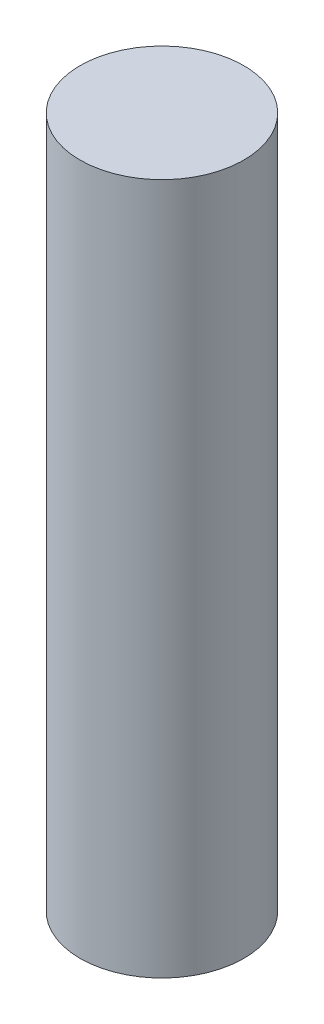
ISO-10303-21;
HEADER;
FILE_DESCRIPTION(('STEP AP214'),'2;1');
FILE_NAME('part.step','',(''),(''),'','','');
FILE_SCHEMA(('AUTOMOTIVE_DESIGN { 1 0 10303 214 1 1 1 1 }'));
ENDSEC;
DATA;
#1=APPLICATION_CONTEXT('core data for automotive mechanical design processes');
#2=APPLICATION_PROTOCOL_DEFINITION('international standard','automotive_design',2000,#1);
#3=PRODUCT_CONTEXT('',#1,'mechanical');
#4=PRODUCT('Part','Part','',(#3));
#5=PRODUCT_RELATED_PRODUCT_CATEGORY('part','',(#4));
#6=PRODUCT_DEFINITION_FORMATION('','',#4);
#7=PRODUCT_DEFINITION_CONTEXT('part definition',#1,'design');
#8=PRODUCT_DEFINITION('design','',#6,#7);
#9=PRODUCT_DEFINITION_SHAPE('','',#8);
#10=(LENGTH_UNIT() NAMED_UNIT(*) SI_UNIT(.MILLI.,.METRE.));
#11=(NAMED_UNIT(*) PLANE_ANGLE_UNIT() SI_UNIT($,.RADIAN.));
#12=(NAMED_UNIT(*) SI_UNIT($,.STERADIAN.) SOLID_ANGLE_UNIT());
#13=UNCERTAINTY_MEASURE_WITH_UNIT(LENGTH_MEASURE(1.E-05),#10,'distance_accuracy_value','');
#14=(GEOMETRIC_REPRESENTATION_CONTEXT(3) GLOBAL_UNCERTAINTY_ASSIGNED_CONTEXT((#13)) GLOBAL_UNIT_ASSIGNED_CONTEXT((#10,
#11,#12)) REPRESENTATION_CONTEXT('',''));
#15=CARTESIAN_POINT('',(0.,0.,0.));
#16=DIRECTION('',(0.,0.,1.));
#17=DIRECTION('',(1.,0.,0.));
#18=AXIS2_PLACEMENT_3D('',#15,#16,#17);
#19=CARTESIAN_POINT('',(0.,215.9,0.));
#20=DIRECTION('',(0.,-1.,0.));
#21=DIRECTION('',(0.,0.,-1.));
#22=AXIS2_PLACEMENT_3D('',#19,#20,#21);
#23=CYLINDRICAL_SURFACE('',#22,25.5651);
#24=CARTESIAN_POINT('',(0.,215.9,0.));
#25=DIRECTION('',(0.,1.,0.));
#26=DIRECTION('',(0.,0.,1.));
#27=AXIS2_PLACEMENT_3D('',#24,#25,#26);
#28=CIRCLE('',#27,25.5651);
#29=CARTESIAN_POINT('',(0.,215.9,25.5651));
#30=VERTEX_POINT('',#29);
#31=EDGE_CURVE('E10',#30,#30,#28,.T.);
#32=ORIENTED_EDGE('',*,*,#31,.F.);
#33=EDGE_LOOP('',(#32));
#34=FACE_BOUND('',#33,.T.);
#35=CARTESIAN_POINT('',(0.,0.,0.));
#36=DIRECTION('',(0.,1.,0.));
#37=DIRECTION('',(0.,0.,1.));
#38=AXIS2_PLACEMENT_3D('',#35,#36,#37);
#39=CIRCLE('',#38,25.5651);
#40=CARTESIAN_POINT('',(0.,0.,25.5651));
#41=VERTEX_POINT('',#40);
#42=EDGE_CURVE('E35',#41,#41,#39,.T.);
#43=ORIENTED_EDGE('',*,*,#42,.T.);
#44=EDGE_LOOP('',(#43));
#45=FACE_BOUND('',#44,.T.);
#46=ADVANCED_FACE('F32',(#34,#45),#23,.T.);
#47=CARTESIAN_POINT('',(0.,215.9,0.));
#48=DIRECTION('',(0.,1.,0.));
#49=DIRECTION('',(0.,0.,1.));
#50=AXIS2_PLACEMENT_3D('',#47,#48,#49);
#51=PLANE('',#50);
#52=ORIENTED_EDGE('',*,*,#31,.T.);
#53=EDGE_LOOP('',(#52));
#54=FACE_BOUND('',#53,.T.);
#55=ADVANCED_FACE('F47',(#54),#51,.T.);
#56=CARTESIAN_POINT('',(0.,0.,0.));
#57=DIRECTION('',(0.,1.,0.));
#58=DIRECTION('',(0.,0.,1.));
#59=AXIS2_PLACEMENT_3D('',#56,#57,#58);
#60=PLANE('',#59);
#61=ORIENTED_EDGE('',*,*,#42,.F.);
#62=EDGE_LOOP('',(#61));
#63=FACE_BOUND('',#62,.T.);
#64=ADVANCED_FACE('F45',(#63),#60,.F.);
#65=CLOSED_SHELL('',(#46,#55,#64));
#66=MANIFOLD_SOLID_BREP('B2',#65);
#67=ADVANCED_BREP_SHAPE_REPRESENTATION('',(#18,#66),#14);
#68=SHAPE_DEFINITION_REPRESENTATION(#9,#67);
ENDSEC;
END-ISO-10303-21;
